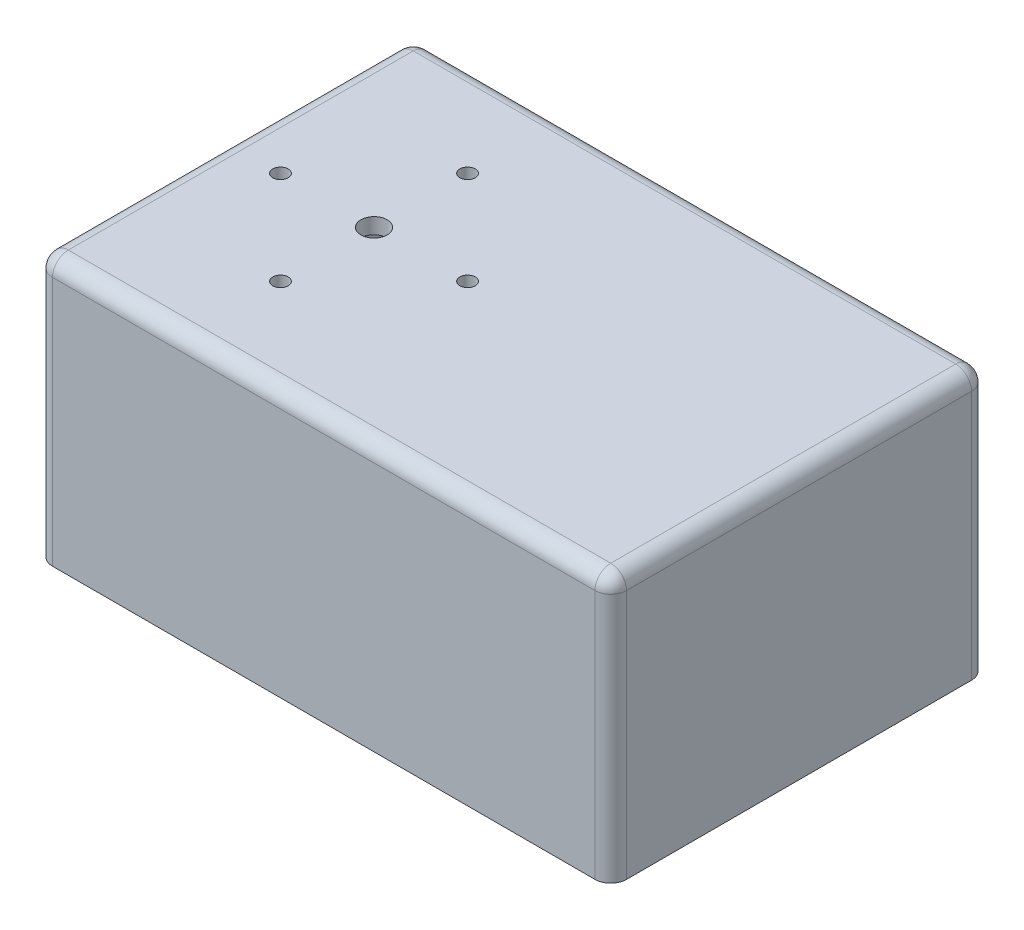
ISO-10303-21;
HEADER;
FILE_DESCRIPTION(('STEP AP214'),'2;1');
FILE_NAME('part.step','',(''),(''),'','','');
FILE_SCHEMA(('AUTOMOTIVE_DESIGN { 1 0 10303 214 1 1 1 1 }'));
ENDSEC;
DATA;
#1=APPLICATION_CONTEXT('core data for automotive mechanical design processes');
#2=APPLICATION_PROTOCOL_DEFINITION('international standard','automotive_design',2000,#1);
#3=PRODUCT_CONTEXT('',#1,'mechanical');
#4=PRODUCT('Part','Part','',(#3));
#5=PRODUCT_RELATED_PRODUCT_CATEGORY('part','',(#4));
#6=PRODUCT_DEFINITION_FORMATION('','',#4);
#7=PRODUCT_DEFINITION_CONTEXT('part definition',#1,'design');
#8=PRODUCT_DEFINITION('design','',#6,#7);
#9=PRODUCT_DEFINITION_SHAPE('','',#8);
#10=(LENGTH_UNIT() NAMED_UNIT(*) SI_UNIT(.MILLI.,.METRE.));
#11=(NAMED_UNIT(*) PLANE_ANGLE_UNIT() SI_UNIT($,.RADIAN.));
#12=(NAMED_UNIT(*) SI_UNIT($,.STERADIAN.) SOLID_ANGLE_UNIT());
#13=UNCERTAINTY_MEASURE_WITH_UNIT(LENGTH_MEASURE(1.E-05),#10,'distance_accuracy_value','');
#14=(GEOMETRIC_REPRESENTATION_CONTEXT(3) GLOBAL_UNCERTAINTY_ASSIGNED_CONTEXT((#13)) GLOBAL_UNIT_ASSIGNED_CONTEXT((#10,
#11,#12)) REPRESENTATION_CONTEXT('',''));
#15=CARTESIAN_POINT('',(0.,0.,0.));
#16=DIRECTION('',(0.,0.,1.));
#17=DIRECTION('',(1.,0.,0.));
#18=AXIS2_PLACEMENT_3D('',#15,#16,#17);
#19=CARTESIAN_POINT('',(109.,101.,-71.5));
#20=DIRECTION('',(-1.,0.,0.));
#21=DIRECTION('',(0.,0.,1.));
#22=AXIS2_PLACEMENT_3D('',#19,#20,#21);
#23=PLANE('',#22);
#24=DIRECTION('',(0.,0.,-1.));
#25=VECTOR('',#24,1.);
#26=CARTESIAN_POINT('',(109.,0.,-71.5));
#27=LINE('',#26,#25);
#28=CARTESIAN_POINT('',(109.,0.,65.5));
#29=VERTEX_POINT('',#28);
#30=CARTESIAN_POINT('',(109.,0.,-65.5));
#31=VERTEX_POINT('',#30);
#32=EDGE_CURVE('E176',#29,#31,#27,.T.);
#33=ORIENTED_EDGE('',*,*,#32,.T.);
#34=DIRECTION('',(0.,-1.,0.));
#35=VECTOR('',#34,1.);
#36=CARTESIAN_POINT('',(109.,101.,-65.5));
#37=LINE('',#36,#35);
#38=CARTESIAN_POINT('',(109.,95.,-65.5));
#39=VERTEX_POINT('',#38);
#40=EDGE_CURVE('E214',#31,#39,#37,.F.);
#41=ORIENTED_EDGE('',*,*,#40,.T.);
#42=DIRECTION('',(0.,0.,-1.));
#43=VECTOR('',#42,1.);
#44=CARTESIAN_POINT('',(109.,95.,71.5));
#45=LINE('',#44,#43);
#46=CARTESIAN_POINT('',(109.,95.,65.5));
#47=VERTEX_POINT('',#46);
#48=EDGE_CURVE('E210',#39,#47,#45,.F.);
#49=ORIENTED_EDGE('',*,*,#48,.T.);
#50=DIRECTION('',(0.,-1.,0.));
#51=VECTOR('',#50,1.);
#52=CARTESIAN_POINT('',(109.,101.,65.5));
#53=LINE('',#52,#51);
#54=EDGE_CURVE('E212',#47,#29,#53,.T.);
#55=ORIENTED_EDGE('',*,*,#54,.T.);
#56=EDGE_LOOP('',(#33,#41,#49,#55));
#57=FACE_BOUND('',#56,.T.);
#58=ADVANCED_FACE('F32',(#57),#23,.F.);
#59=CARTESIAN_POINT('',(-109.,101.,-71.5));
#60=DIRECTION('',(0.,0.,1.));
#61=DIRECTION('',(1.,0.,0.));
#62=AXIS2_PLACEMENT_3D('',#59,#60,#61);
#63=PLANE('',#62);
#64=DIRECTION('',(-1.,0.,0.));
#65=VECTOR('',#64,1.);
#66=CARTESIAN_POINT('',(-109.,0.,-71.5));
#67=LINE('',#66,#65);
#68=CARTESIAN_POINT('',(103.,0.,-71.5));
#69=VERTEX_POINT('',#68);
#70=CARTESIAN_POINT('',(-103.,0.,-71.5));
#71=VERTEX_POINT('',#70);
#72=EDGE_CURVE('E179',#69,#71,#67,.T.);
#73=ORIENTED_EDGE('',*,*,#72,.T.);
#74=DIRECTION('',(0.,-1.,0.));
#75=VECTOR('',#74,1.);
#76=CARTESIAN_POINT('',(-103.,101.,-71.5));
#77=LINE('',#76,#75);
#78=CARTESIAN_POINT('',(-103.,95.,-71.5));
#79=VERTEX_POINT('',#78);
#80=EDGE_CURVE('E208',#71,#79,#77,.F.);
#81=ORIENTED_EDGE('',*,*,#80,.T.);
#82=DIRECTION('',(-1.,0.,0.));
#83=VECTOR('',#82,1.);
#84=CARTESIAN_POINT('',(109.,95.,-71.5));
#85=LINE('',#84,#83);
#86=CARTESIAN_POINT('',(103.,95.,-71.5));
#87=VERTEX_POINT('',#86);
#88=EDGE_CURVE('E204',#79,#87,#85,.F.);
#89=ORIENTED_EDGE('',*,*,#88,.T.);
#90=DIRECTION('',(0.,-1.,0.));
#91=VECTOR('',#90,1.);
#92=CARTESIAN_POINT('',(103.,101.,-71.5));
#93=LINE('',#92,#91);
#94=EDGE_CURVE('E206',#87,#69,#93,.T.);
#95=ORIENTED_EDGE('',*,*,#94,.T.);
#96=EDGE_LOOP('',(#73,#81,#89,#95));
#97=FACE_BOUND('',#96,.T.);
#98=ADVANCED_FACE('F290',(#97),#63,.F.);
#99=CARTESIAN_POINT('',(-109.,101.,-71.5));
#100=DIRECTION('',(1.,0.,0.));
#101=DIRECTION('',(0.,0.,-1.));
#102=AXIS2_PLACEMENT_3D('',#99,#100,#101);
#103=PLANE('',#102);
#104=DIRECTION('',(0.,0.,1.));
#105=VECTOR('',#104,1.);
#106=CARTESIAN_POINT('',(-109.,95.,-71.5));
#107=LINE('',#106,#105);
#108=CARTESIAN_POINT('',(-109.,95.,65.5));
#109=VERTEX_POINT('',#108);
#110=CARTESIAN_POINT('',(-109.,95.,-65.5));
#111=VERTEX_POINT('',#110);
#112=EDGE_CURVE('E189',#109,#111,#107,.F.);
#113=ORIENTED_EDGE('',*,*,#112,.T.);
#114=DIRECTION('',(0.,-1.,0.));
#115=VECTOR('',#114,1.);
#116=CARTESIAN_POINT('',(-109.,101.,-65.5));
#117=LINE('',#116,#115);
#118=CARTESIAN_POINT('',(-109.,0.,-65.5));
#119=VERTEX_POINT('',#118);
#120=EDGE_CURVE('E193',#111,#119,#117,.T.);
#121=ORIENTED_EDGE('',*,*,#120,.T.);
#122=DIRECTION('',(0.,0.,1.));
#123=VECTOR('',#122,1.);
#124=CARTESIAN_POINT('',(-109.,0.,-71.5));
#125=LINE('',#124,#123);
#126=CARTESIAN_POINT('',(-109.,0.,65.5));
#127=VERTEX_POINT('',#126);
#128=EDGE_CURVE('E183',#119,#127,#125,.T.);
#129=ORIENTED_EDGE('',*,*,#128,.T.);
#130=DIRECTION('',(0.,-1.,0.));
#131=VECTOR('',#130,1.);
#132=CARTESIAN_POINT('',(-109.,101.,65.5));
#133=LINE('',#132,#131);
#134=EDGE_CURVE('E191',#127,#109,#133,.F.);
#135=ORIENTED_EDGE('',*,*,#134,.T.);
#136=EDGE_LOOP('',(#113,#121,#129,#135));
#137=FACE_BOUND('',#136,.T.);
#138=ADVANCED_FACE('F296',(#137),#103,.F.);
#139=CARTESIAN_POINT('',(-109.,101.,71.5));
#140=DIRECTION('',(0.,0.,-1.));
#141=DIRECTION('',(-1.,0.,0.));
#142=AXIS2_PLACEMENT_3D('',#139,#140,#141);
#143=PLANE('',#142);
#144=DIRECTION('',(1.,0.,0.));
#145=VECTOR('',#144,1.);
#146=CARTESIAN_POINT('',(-109.,0.,71.5));
#147=LINE('',#146,#145);
#148=CARTESIAN_POINT('',(-103.,0.,71.5));
#149=VERTEX_POINT('',#148);
#150=CARTESIAN_POINT('',(103.,0.,71.5));
#151=VERTEX_POINT('',#150);
#152=EDGE_CURVE('E186',#149,#151,#147,.T.);
#153=ORIENTED_EDGE('',*,*,#152,.T.);
#154=DIRECTION('',(0.,-1.,0.));
#155=VECTOR('',#154,1.);
#156=CARTESIAN_POINT('',(103.,101.,71.5));
#157=LINE('',#156,#155);
#158=CARTESIAN_POINT('',(103.,95.,71.5));
#159=VERTEX_POINT('',#158);
#160=EDGE_CURVE('E220',#151,#159,#157,.F.);
#161=ORIENTED_EDGE('',*,*,#160,.T.);
#162=DIRECTION('',(1.,0.,0.));
#163=VECTOR('',#162,1.);
#164=CARTESIAN_POINT('',(-109.,95.,71.5));
#165=LINE('',#164,#163);
#166=CARTESIAN_POINT('',(-103.,95.,71.5));
#167=VERTEX_POINT('',#166);
#168=EDGE_CURVE('E216',#159,#167,#165,.F.);
#169=ORIENTED_EDGE('',*,*,#168,.T.);
#170=DIRECTION('',(0.,-1.,0.));
#171=VECTOR('',#170,1.);
#172=CARTESIAN_POINT('',(-103.,101.,71.5));
#173=LINE('',#172,#171);
#174=EDGE_CURVE('E218',#167,#149,#173,.T.);
#175=ORIENTED_EDGE('',*,*,#174,.T.);
#176=EDGE_LOOP('',(#153,#161,#169,#175));
#177=FACE_BOUND('',#176,.T.);
#178=ADVANCED_FACE('F357',(#177),#143,.F.);
#179=CARTESIAN_POINT('',(0.,101.,0.));
#180=DIRECTION('',(0.,1.,0.));
#181=DIRECTION('',(0.,0.,1.));
#182=AXIS2_PLACEMENT_3D('',#179,#180,#181);
#183=PLANE('',#182);
#184=CARTESIAN_POINT('',(-52.4,101.,-35.525));
#185=DIRECTION('',(0.,1.,0.));
#186=DIRECTION('',(0.,0.,1.));
#187=AXIS2_PLACEMENT_3D('',#184,#185,#186);
#188=CIRCLE('',#187,2.925);
#189=CARTESIAN_POINT('',(-52.4,101.,-32.6));
#190=VERTEX_POINT('',#189);
#191=EDGE_CURVE('E590',#190,#190,#188,.T.);
#192=ORIENTED_EDGE('',*,*,#191,.F.);
#193=EDGE_LOOP('',(#192));
#194=FACE_BOUND('',#193,.T.);
#195=CARTESIAN_POINT('',(-87.925,101.,0.));
#196=DIRECTION('',(0.,1.,0.));
#197=DIRECTION('',(0.,0.,1.));
#198=AXIS2_PLACEMENT_3D('',#195,#196,#197);
#199=CIRCLE('',#198,2.925);
#200=CARTESIAN_POINT('',(-87.925,101.,2.925));
#201=VERTEX_POINT('',#200);
#202=EDGE_CURVE('E586',#201,#201,#199,.T.);
#203=ORIENTED_EDGE('',*,*,#202,.F.);
#204=EDGE_LOOP('',(#203));
#205=FACE_BOUND('',#204,.T.);
#206=CARTESIAN_POINT('',(-52.4,101.,35.525));
#207=DIRECTION('',(0.,1.,0.));
#208=DIRECTION('',(0.,0.,1.));
#209=AXIS2_PLACEMENT_3D('',#206,#207,#208);
#210=CIRCLE('',#209,2.925);
#211=CARTESIAN_POINT('',(-52.4,101.,38.45));
#212=VERTEX_POINT('',#211);
#213=EDGE_CURVE('E576',#212,#212,#210,.T.);
#214=ORIENTED_EDGE('',*,*,#213,.F.);
#215=EDGE_LOOP('',(#214));
#216=FACE_BOUND('',#215,.T.);
#217=CARTESIAN_POINT('',(-16.875,101.,0.));
#218=DIRECTION('',(0.,1.,0.));
#219=DIRECTION('',(0.,0.,1.));
#220=AXIS2_PLACEMENT_3D('',#217,#218,#219);
#221=CIRCLE('',#220,2.925);
#222=CARTESIAN_POINT('',(-16.875,101.,2.925));
#223=VERTEX_POINT('',#222);
#224=EDGE_CURVE('E587',#223,#223,#221,.T.);
#225=ORIENTED_EDGE('',*,*,#224,.F.);
#226=EDGE_LOOP('',(#225));
#227=FACE_BOUND('',#226,.T.);
#228=CARTESIAN_POINT('',(-52.4,101.,0.));
#229=DIRECTION('',(0.,1.,0.));
#230=DIRECTION('',(0.,0.,1.));
#231=AXIS2_PLACEMENT_3D('',#228,#229,#230);
#232=CIRCLE('',#231,5.);
#233=CARTESIAN_POINT('',(-52.4,101.,5.));
#234=VERTEX_POINT('',#233);
#235=EDGE_CURVE('E160',#234,#234,#232,.T.);
#236=ORIENTED_EDGE('',*,*,#235,.F.);
#237=EDGE_LOOP('',(#236));
#238=FACE_BOUND('',#237,.T.);
#239=DIRECTION('',(-1.,0.,0.));
#240=VECTOR('',#239,1.);
#241=CARTESIAN_POINT('',(-109.,101.,-65.5));
#242=LINE('',#241,#240);
#243=CARTESIAN_POINT('',(103.,101.,-65.5));
#244=VERTEX_POINT('',#243);
#245=CARTESIAN_POINT('',(-103.,101.,-65.5));
#246=VERTEX_POINT('',#245);
#247=EDGE_CURVE('E41',#244,#246,#242,.T.);
#248=ORIENTED_EDGE('',*,*,#247,.T.);
#249=DIRECTION('',(0.,0.,1.));
#250=VECTOR('',#249,1.);
#251=CARTESIAN_POINT('',(-103.,101.,71.5));
#252=LINE('',#251,#250);
#253=CARTESIAN_POINT('',(-103.,101.,65.5));
#254=VERTEX_POINT('',#253);
#255=EDGE_CURVE('E11',#246,#254,#252,.T.);
#256=ORIENTED_EDGE('',*,*,#255,.T.);
#257=DIRECTION('',(1.,0.,0.));
#258=VECTOR('',#257,1.);
#259=CARTESIAN_POINT('',(109.,101.,65.5));
#260=LINE('',#259,#258);
#261=CARTESIAN_POINT('',(103.,101.,65.5));
#262=VERTEX_POINT('',#261);
#263=EDGE_CURVE('E222',#254,#262,#260,.T.);
#264=ORIENTED_EDGE('',*,*,#263,.T.);
#265=DIRECTION('',(0.,0.,-1.));
#266=VECTOR('',#265,1.);
#267=CARTESIAN_POINT('',(103.,101.,-71.5));
#268=LINE('',#267,#266);
#269=EDGE_CURVE('E224',#262,#244,#268,.T.);
#270=ORIENTED_EDGE('',*,*,#269,.T.);
#271=EDGE_LOOP('',(#248,#256,#264,#270));
#272=FACE_BOUND('',#271,.T.);
#273=ADVANCED_FACE('F381',(#194,#205,#216,#227,#238,#272),#183,.T.);
#274=CARTESIAN_POINT('',(0.,0.,0.));
#275=DIRECTION('',(0.,1.,0.));
#276=DIRECTION('',(0.,0.,1.));
#277=AXIS2_PLACEMENT_3D('',#274,#275,#276);
#278=PLANE('',#277);
#279=DIRECTION('',(-1.,0.,0.));
#280=VECTOR('',#279,1.);
#281=CARTESIAN_POINT('',(-109.,0.,-65.5));
#282=LINE('',#281,#280);
#283=CARTESIAN_POINT('',(103.,0.,-65.5));
#284=VERTEX_POINT('',#283);
#285=CARTESIAN_POINT('',(-103.,0.,-65.5));
#286=VERTEX_POINT('',#285);
#287=EDGE_CURVE('E156',#284,#286,#282,.T.);
#288=ORIENTED_EDGE('',*,*,#287,.T.);
#289=DIRECTION('',(0.,0.,1.));
#290=VECTOR('',#289,1.);
#291=CARTESIAN_POINT('',(-103.,0.,-71.5));
#292=LINE('',#291,#290);
#293=CARTESIAN_POINT('',(-103.,0.,65.5));
#294=VERTEX_POINT('',#293);
#295=EDGE_CURVE('E172',#286,#294,#292,.T.);
#296=ORIENTED_EDGE('',*,*,#295,.T.);
#297=DIRECTION('',(1.,0.,0.));
#298=VECTOR('',#297,1.);
#299=CARTESIAN_POINT('',(-109.,0.,65.5));
#300=LINE('',#299,#298);
#301=CARTESIAN_POINT('',(103.,0.,65.5));
#302=VERTEX_POINT('',#301);
#303=EDGE_CURVE('E152',#294,#302,#300,.T.);
#304=ORIENTED_EDGE('',*,*,#303,.T.);
#305=DIRECTION('',(0.,0.,-1.));
#306=VECTOR('',#305,1.);
#307=CARTESIAN_POINT('',(103.,0.,-71.5));
#308=LINE('',#307,#306);
#309=EDGE_CURVE('E49',#302,#284,#308,.T.);
#310=ORIENTED_EDGE('',*,*,#309,.T.);
#311=EDGE_LOOP('',(#288,#296,#304,#310));
#312=FACE_BOUND('',#311,.T.);
#313=ORIENTED_EDGE('',*,*,#128,.F.);
#314=CARTESIAN_POINT('',(-103.,0.,-65.5));
#315=DIRECTION('',(0.,1.,0.));
#316=DIRECTION('',(0.,0.,1.));
#317=AXIS2_PLACEMENT_3D('',#314,#315,#316);
#318=CIRCLE('',#317,6.);
#319=EDGE_CURVE('E202',#119,#71,#318,.F.);
#320=ORIENTED_EDGE('',*,*,#319,.T.);
#321=ORIENTED_EDGE('',*,*,#72,.F.);
#322=CARTESIAN_POINT('',(103.,0.,-65.5));
#323=DIRECTION('',(0.,1.,0.));
#324=DIRECTION('',(0.,0.,1.));
#325=AXIS2_PLACEMENT_3D('',#322,#323,#324);
#326=CIRCLE('',#325,6.);
#327=EDGE_CURVE('E200',#69,#31,#326,.F.);
#328=ORIENTED_EDGE('',*,*,#327,.T.);
#329=ORIENTED_EDGE('',*,*,#32,.F.);
#330=CARTESIAN_POINT('',(103.,0.,65.5));
#331=DIRECTION('',(0.,1.,0.));
#332=DIRECTION('',(0.,0.,1.));
#333=AXIS2_PLACEMENT_3D('',#330,#331,#332);
#334=CIRCLE('',#333,6.);
#335=EDGE_CURVE('E198',#29,#151,#334,.F.);
#336=ORIENTED_EDGE('',*,*,#335,.T.);
#337=ORIENTED_EDGE('',*,*,#152,.F.);
#338=CARTESIAN_POINT('',(-103.,0.,65.5));
#339=DIRECTION('',(0.,1.,0.));
#340=DIRECTION('',(0.,0.,1.));
#341=AXIS2_PLACEMENT_3D('',#338,#339,#340);
#342=CIRCLE('',#341,6.);
#343=EDGE_CURVE('E196',#149,#127,#342,.F.);
#344=ORIENTED_EDGE('',*,*,#343,.T.);
#345=EDGE_LOOP('',(#313,#320,#321,#328,#329,#336,#337,#344));
#346=FACE_BOUND('',#345,.T.);
#347=ADVANCED_FACE('F346',(#312,#346),#278,.F.);
#348=CARTESIAN_POINT('',(103.,101.,65.5));
#349=DIRECTION('',(0.,-1.,0.));
#350=DIRECTION('',(0.,0.,-1.));
#351=AXIS2_PLACEMENT_3D('',#348,#349,#350);
#352=CYLINDRICAL_SURFACE('',#351,6.);
#353=CARTESIAN_POINT('',(103.,95.,65.5));
#354=DIRECTION('',(0.,1.,0.));
#355=DIRECTION('',(0.,0.,1.));
#356=AXIS2_PLACEMENT_3D('',#353,#354,#355);
#357=CIRCLE('',#356,6.);
#358=EDGE_CURVE('E180',#159,#47,#357,.T.);
#359=ORIENTED_EDGE('',*,*,#358,.F.);
#360=ORIENTED_EDGE('',*,*,#160,.F.);
#361=ORIENTED_EDGE('',*,*,#335,.F.);
#362=ORIENTED_EDGE('',*,*,#54,.F.);
#363=EDGE_LOOP('',(#359,#360,#361,#362));
#364=FACE_BOUND('',#363,.T.);
#365=ADVANCED_FACE('F34',(#364),#352,.T.);
#366=CARTESIAN_POINT('',(103.,95.,65.5));
#367=DIRECTION('',(1.,0.,0.));
#368=DIRECTION('',(0.,0.,-1.));
#369=AXIS2_PLACEMENT_3D('',#366,#367,#368);
#370=SPHERICAL_SURFACE('',#369,6.);
#371=CARTESIAN_POINT('',(103.,95.,65.5));
#372=DIRECTION('',(1.,0.,0.));
#373=DIRECTION('',(0.,0.,-1.));
#374=AXIS2_PLACEMENT_3D('',#371,#372,#373);
#375=CIRCLE('',#374,6.);
#376=EDGE_CURVE('E252',#159,#262,#375,.F.);
#377=ORIENTED_EDGE('',*,*,#376,.F.);
#378=ORIENTED_EDGE('',*,*,#358,.T.);
#379=CARTESIAN_POINT('',(103.,95.,65.5));
#380=DIRECTION('',(0.,0.,1.));
#381=DIRECTION('',(1.,0.,0.));
#382=AXIS2_PLACEMENT_3D('',#379,#380,#381);
#383=CIRCLE('',#382,6.);
#384=EDGE_CURVE('E255',#262,#47,#383,.F.);
#385=ORIENTED_EDGE('',*,*,#384,.F.);
#386=EDGE_LOOP('',(#377,#378,#385));
#387=FACE_BOUND('',#386,.T.);
#388=ADVANCED_FACE('F339',(#387),#370,.T.);
#389=CARTESIAN_POINT('',(103.,101.,-65.5));
#390=DIRECTION('',(0.,-1.,0.));
#391=DIRECTION('',(0.,0.,-1.));
#392=AXIS2_PLACEMENT_3D('',#389,#390,#391);
#393=CYLINDRICAL_SURFACE('',#392,6.);
#394=ORIENTED_EDGE('',*,*,#327,.F.);
#395=ORIENTED_EDGE('',*,*,#94,.F.);
#396=CARTESIAN_POINT('',(103.,95.,-65.5));
#397=DIRECTION('',(0.,1.,0.));
#398=DIRECTION('',(0.,0.,1.));
#399=AXIS2_PLACEMENT_3D('',#396,#397,#398);
#400=CIRCLE('',#399,6.);
#401=EDGE_CURVE('E249',#39,#87,#400,.T.);
#402=ORIENTED_EDGE('',*,*,#401,.F.);
#403=ORIENTED_EDGE('',*,*,#40,.F.);
#404=EDGE_LOOP('',(#394,#395,#402,#403));
#405=FACE_BOUND('',#404,.T.);
#406=ADVANCED_FACE('F336',(#405),#393,.T.);
#407=CARTESIAN_POINT('',(103.,95.,0.));
#408=DIRECTION('',(0.,0.,1.));
#409=DIRECTION('',(1.,0.,0.));
#410=AXIS2_PLACEMENT_3D('',#407,#408,#409);
#411=CYLINDRICAL_SURFACE('',#410,6.);
#412=ORIENTED_EDGE('',*,*,#384,.T.);
#413=ORIENTED_EDGE('',*,*,#48,.F.);
#414=CARTESIAN_POINT('',(103.,95.,-65.5));
#415=DIRECTION('',(0.,0.,-1.));
#416=DIRECTION('',(-1.,0.,0.));
#417=AXIS2_PLACEMENT_3D('',#414,#415,#416);
#418=CIRCLE('',#417,6.);
#419=EDGE_CURVE('E246',#244,#39,#418,.T.);
#420=ORIENTED_EDGE('',*,*,#419,.F.);
#421=ORIENTED_EDGE('',*,*,#269,.F.);
#422=EDGE_LOOP('',(#412,#413,#420,#421));
#423=FACE_BOUND('',#422,.T.);
#424=ADVANCED_FACE('F332',(#423),#411,.T.);
#425=CARTESIAN_POINT('',(0.,95.,65.5));
#426=DIRECTION('',(-1.,0.,0.));
#427=DIRECTION('',(0.,0.,1.));
#428=AXIS2_PLACEMENT_3D('',#425,#426,#427);
#429=CYLINDRICAL_SURFACE('',#428,6.);
#430=ORIENTED_EDGE('',*,*,#376,.T.);
#431=ORIENTED_EDGE('',*,*,#263,.F.);
#432=CARTESIAN_POINT('',(-103.,95.,65.5));
#433=DIRECTION('',(-1.,0.,0.));
#434=DIRECTION('',(0.,0.,1.));
#435=AXIS2_PLACEMENT_3D('',#432,#433,#434);
#436=CIRCLE('',#435,6.);
#437=EDGE_CURVE('E243',#167,#254,#436,.T.);
#438=ORIENTED_EDGE('',*,*,#437,.F.);
#439=ORIENTED_EDGE('',*,*,#168,.F.);
#440=EDGE_LOOP('',(#430,#431,#438,#439));
#441=FACE_BOUND('',#440,.T.);
#442=ADVANCED_FACE('F328',(#441),#429,.T.);
#443=CARTESIAN_POINT('',(-103.,101.,65.5));
#444=DIRECTION('',(0.,-1.,0.));
#445=DIRECTION('',(0.,0.,-1.));
#446=AXIS2_PLACEMENT_3D('',#443,#444,#445);
#447=CYLINDRICAL_SURFACE('',#446,6.);
#448=ORIENTED_EDGE('',*,*,#343,.F.);
#449=ORIENTED_EDGE('',*,*,#174,.F.);
#450=CARTESIAN_POINT('',(-103.,95.,65.5));
#451=DIRECTION('',(0.,1.,0.));
#452=DIRECTION('',(0.,0.,1.));
#453=AXIS2_PLACEMENT_3D('',#450,#451,#452);
#454=CIRCLE('',#453,6.);
#455=EDGE_CURVE('E240',#109,#167,#454,.T.);
#456=ORIENTED_EDGE('',*,*,#455,.F.);
#457=ORIENTED_EDGE('',*,*,#134,.F.);
#458=EDGE_LOOP('',(#448,#449,#456,#457));
#459=FACE_BOUND('',#458,.T.);
#460=ADVANCED_FACE('F324',(#459),#447,.T.);
#461=CARTESIAN_POINT('',(103.,95.,-65.5));
#462=DIRECTION('',(1.,0.,0.));
#463=DIRECTION('',(0.,0.,-1.));
#464=AXIS2_PLACEMENT_3D('',#461,#462,#463);
#465=SPHERICAL_SURFACE('',#464,6.);
#466=ORIENTED_EDGE('',*,*,#419,.T.);
#467=ORIENTED_EDGE('',*,*,#401,.T.);
#468=CARTESIAN_POINT('',(103.,95.,-65.5));
#469=DIRECTION('',(1.,0.,0.));
#470=DIRECTION('',(0.,0.,-1.));
#471=AXIS2_PLACEMENT_3D('',#468,#469,#470);
#472=CIRCLE('',#471,6.);
#473=EDGE_CURVE('E237',#244,#87,#472,.F.);
#474=ORIENTED_EDGE('',*,*,#473,.F.);
#475=EDGE_LOOP('',(#466,#467,#474));
#476=FACE_BOUND('',#475,.T.);
#477=ADVANCED_FACE('F320',(#476),#465,.T.);
#478=CARTESIAN_POINT('',(-103.,95.,65.5));
#479=DIRECTION('',(0.,0.,1.));
#480=DIRECTION('',(1.,0.,0.));
#481=AXIS2_PLACEMENT_3D('',#478,#479,#480);
#482=SPHERICAL_SURFACE('',#481,6.);
#483=ORIENTED_EDGE('',*,*,#455,.T.);
#484=ORIENTED_EDGE('',*,*,#437,.T.);
#485=CARTESIAN_POINT('',(-103.,95.,65.5));
#486=DIRECTION('',(0.,0.,1.));
#487=DIRECTION('',(1.,0.,0.));
#488=AXIS2_PLACEMENT_3D('',#485,#486,#487);
#489=CIRCLE('',#488,6.);
#490=EDGE_CURVE('E235',#109,#254,#489,.F.);
#491=ORIENTED_EDGE('',*,*,#490,.F.);
#492=EDGE_LOOP('',(#483,#484,#491));
#493=FACE_BOUND('',#492,.T.);
#494=ADVANCED_FACE('F316',(#493),#482,.T.);
#495=CARTESIAN_POINT('',(0.,95.,-65.5));
#496=DIRECTION('',(1.,0.,0.));
#497=DIRECTION('',(0.,0.,-1.));
#498=AXIS2_PLACEMENT_3D('',#495,#496,#497);
#499=CYLINDRICAL_SURFACE('',#498,6.);
#500=ORIENTED_EDGE('',*,*,#473,.T.);
#501=ORIENTED_EDGE('',*,*,#88,.F.);
#502=CARTESIAN_POINT('',(-103.,95.,-65.5));
#503=DIRECTION('',(-1.,0.,0.));
#504=DIRECTION('',(0.,0.,1.));
#505=AXIS2_PLACEMENT_3D('',#502,#503,#504);
#506=CIRCLE('',#505,6.);
#507=EDGE_CURVE('E232',#246,#79,#506,.T.);
#508=ORIENTED_EDGE('',*,*,#507,.F.);
#509=ORIENTED_EDGE('',*,*,#247,.F.);
#510=EDGE_LOOP('',(#500,#501,#508,#509));
#511=FACE_BOUND('',#510,.T.);
#512=ADVANCED_FACE('F312',(#511),#499,.T.);
#513=CARTESIAN_POINT('',(-103.,95.,0.));
#514=DIRECTION('',(0.,0.,-1.));
#515=DIRECTION('',(-1.,0.,0.));
#516=AXIS2_PLACEMENT_3D('',#513,#514,#515);
#517=CYLINDRICAL_SURFACE('',#516,6.);
#518=ORIENTED_EDGE('',*,*,#490,.T.);
#519=ORIENTED_EDGE('',*,*,#255,.F.);
#520=CARTESIAN_POINT('',(-103.,95.,-65.5));
#521=DIRECTION('',(0.,0.,-1.));
#522=DIRECTION('',(-1.,0.,0.));
#523=AXIS2_PLACEMENT_3D('',#520,#521,#522);
#524=CIRCLE('',#523,6.);
#525=EDGE_CURVE('E229',#111,#246,#524,.T.);
#526=ORIENTED_EDGE('',*,*,#525,.F.);
#527=ORIENTED_EDGE('',*,*,#112,.F.);
#528=EDGE_LOOP('',(#518,#519,#526,#527));
#529=FACE_BOUND('',#528,.T.);
#530=ADVANCED_FACE('F308',(#529),#517,.T.);
#531=CARTESIAN_POINT('',(-103.,95.,-65.5));
#532=DIRECTION('',(0.,1.,0.));
#533=DIRECTION('',(0.,0.,1.));
#534=AXIS2_PLACEMENT_3D('',#531,#532,#533);
#535=SPHERICAL_SURFACE('',#534,6.);
#536=ORIENTED_EDGE('',*,*,#525,.T.);
#537=ORIENTED_EDGE('',*,*,#507,.T.);
#538=CARTESIAN_POINT('',(-103.,95.,-65.5));
#539=DIRECTION('',(0.,1.,0.));
#540=DIRECTION('',(0.,0.,1.));
#541=AXIS2_PLACEMENT_3D('',#538,#539,#540);
#542=CIRCLE('',#541,6.);
#543=EDGE_CURVE('E166',#111,#79,#542,.F.);
#544=ORIENTED_EDGE('',*,*,#543,.F.);
#545=EDGE_LOOP('',(#536,#537,#544));
#546=FACE_BOUND('',#545,.T.);
#547=ADVANCED_FACE('F304',(#546),#535,.T.);
#548=CARTESIAN_POINT('',(-103.,101.,-65.5));
#549=DIRECTION('',(0.,-1.,0.));
#550=DIRECTION('',(0.,0.,-1.));
#551=AXIS2_PLACEMENT_3D('',#548,#549,#550);
#552=CYLINDRICAL_SURFACE('',#551,6.);
#553=ORIENTED_EDGE('',*,*,#543,.T.);
#554=ORIENTED_EDGE('',*,*,#80,.F.);
#555=ORIENTED_EDGE('',*,*,#319,.F.);
#556=ORIENTED_EDGE('',*,*,#120,.F.);
#557=EDGE_LOOP('',(#553,#554,#555,#556));
#558=FACE_BOUND('',#557,.T.);
#559=ADVANCED_FACE('F301',(#558),#552,.T.);
#560=CARTESIAN_POINT('',(103.,101.,-71.5));
#561=DIRECTION('',(-1.,0.,0.));
#562=DIRECTION('',(0.,0.,1.));
#563=AXIS2_PLACEMENT_3D('',#560,#561,#562);
#564=PLANE('',#563);
#565=ORIENTED_EDGE('',*,*,#309,.F.);
#566=DIRECTION('',(0.,1.,0.));
#567=VECTOR('',#566,1.);
#568=CARTESIAN_POINT('',(103.,101.,65.5));
#569=LINE('',#568,#567);
#570=CARTESIAN_POINT('',(103.,95.,65.5));
#571=VERTEX_POINT('',#570);
#572=EDGE_CURVE('E139',#302,#571,#569,.T.);
#573=ORIENTED_EDGE('',*,*,#572,.T.);
#574=DIRECTION('',(0.,0.,1.));
#575=VECTOR('',#574,1.);
#576=CARTESIAN_POINT('',(103.,95.,0.));
#577=LINE('',#576,#575);
#578=CARTESIAN_POINT('',(103.,95.,-65.5));
#579=VERTEX_POINT('',#578);
#580=EDGE_CURVE('E133',#579,#571,#577,.T.);
#581=ORIENTED_EDGE('',*,*,#580,.F.);
#582=DIRECTION('',(0.,-1.,0.));
#583=VECTOR('',#582,1.);
#584=CARTESIAN_POINT('',(103.,101.,-65.5));
#585=LINE('',#584,#583);
#586=EDGE_CURVE('E137',#579,#284,#585,.T.);
#587=ORIENTED_EDGE('',*,*,#586,.T.);
#588=EDGE_LOOP('',(#565,#573,#581,#587));
#589=FACE_BOUND('',#588,.T.);
#590=ADVANCED_FACE('F135',(#589),#564,.T.);
#591=CARTESIAN_POINT('',(-109.,101.,-65.5));
#592=DIRECTION('',(0.,0.,1.));
#593=DIRECTION('',(1.,0.,0.));
#594=AXIS2_PLACEMENT_3D('',#591,#592,#593);
#595=PLANE('',#594);
#596=ORIENTED_EDGE('',*,*,#287,.F.);
#597=ORIENTED_EDGE('',*,*,#586,.F.);
#598=DIRECTION('',(1.,0.,0.));
#599=VECTOR('',#598,1.);
#600=CARTESIAN_POINT('',(0.,95.,-65.5));
#601=LINE('',#600,#599);
#602=CARTESIAN_POINT('',(-103.,95.,-65.5));
#603=VERTEX_POINT('',#602);
#604=EDGE_CURVE('E146',#603,#579,#601,.T.);
#605=ORIENTED_EDGE('',*,*,#604,.F.);
#606=DIRECTION('',(0.,1.,0.));
#607=VECTOR('',#606,1.);
#608=CARTESIAN_POINT('',(-103.,101.,-65.5));
#609=LINE('',#608,#607);
#610=EDGE_CURVE('E143',#286,#603,#609,.T.);
#611=ORIENTED_EDGE('',*,*,#610,.F.);
#612=EDGE_LOOP('',(#596,#597,#605,#611));
#613=FACE_BOUND('',#612,.T.);
#614=ADVANCED_FACE('F154',(#613),#595,.T.);
#615=CARTESIAN_POINT('',(-103.,101.,-71.5));
#616=DIRECTION('',(1.,0.,0.));
#617=DIRECTION('',(0.,0.,-1.));
#618=AXIS2_PLACEMENT_3D('',#615,#616,#617);
#619=PLANE('',#618);
#620=DIRECTION('',(0.,0.,1.));
#621=VECTOR('',#620,1.);
#622=CARTESIAN_POINT('',(-103.,95.,-71.5));
#623=LINE('',#622,#621);
#624=CARTESIAN_POINT('',(-103.,95.,65.5));
#625=VERTEX_POINT('',#624);
#626=EDGE_CURVE('E149',#603,#625,#623,.T.);
#627=ORIENTED_EDGE('',*,*,#626,.T.);
#628=DIRECTION('',(0.,-1.,0.));
#629=VECTOR('',#628,1.);
#630=CARTESIAN_POINT('',(-103.,101.,65.5));
#631=LINE('',#630,#629);
#632=EDGE_CURVE('E142',#625,#294,#631,.T.);
#633=ORIENTED_EDGE('',*,*,#632,.T.);
#634=ORIENTED_EDGE('',*,*,#295,.F.);
#635=ORIENTED_EDGE('',*,*,#610,.T.);
#636=EDGE_LOOP('',(#627,#633,#634,#635));
#637=FACE_BOUND('',#636,.T.);
#638=ADVANCED_FACE('F503',(#637),#619,.T.);
#639=CARTESIAN_POINT('',(-109.,101.,65.5));
#640=DIRECTION('',(0.,0.,-1.));
#641=DIRECTION('',(-1.,0.,0.));
#642=AXIS2_PLACEMENT_3D('',#639,#640,#641);
#643=PLANE('',#642);
#644=ORIENTED_EDGE('',*,*,#303,.F.);
#645=ORIENTED_EDGE('',*,*,#632,.F.);
#646=DIRECTION('',(1.,0.,0.));
#647=VECTOR('',#646,1.);
#648=CARTESIAN_POINT('',(-109.,95.,65.5));
#649=LINE('',#648,#647);
#650=EDGE_CURVE('E163',#625,#571,#649,.T.);
#651=ORIENTED_EDGE('',*,*,#650,.T.);
#652=ORIENTED_EDGE('',*,*,#572,.F.);
#653=EDGE_LOOP('',(#644,#645,#651,#652));
#654=FACE_BOUND('',#653,.T.);
#655=ADVANCED_FACE('F512',(#654),#643,.T.);
#656=CARTESIAN_POINT('',(0.,95.,0.));
#657=DIRECTION('',(0.,1.,0.));
#658=DIRECTION('',(0.,0.,1.));
#659=AXIS2_PLACEMENT_3D('',#656,#657,#658);
#660=PLANE('',#659);
#661=CARTESIAN_POINT('',(-52.4,95.,-35.525));
#662=DIRECTION('',(0.,1.,0.));
#663=DIRECTION('',(0.,0.,1.));
#664=AXIS2_PLACEMENT_3D('',#661,#662,#663);
#665=CIRCLE('',#664,2.925);
#666=CARTESIAN_POINT('',(-52.4,95.,-32.6));
#667=VERTEX_POINT('',#666);
#668=EDGE_CURVE('E36',#667,#667,#665,.T.);
#669=ORIENTED_EDGE('',*,*,#668,.T.);
#670=EDGE_LOOP('',(#669));
#671=FACE_BOUND('',#670,.T.);
#672=CARTESIAN_POINT('',(-87.925,95.,0.));
#673=DIRECTION('',(0.,1.,0.));
#674=DIRECTION('',(0.,0.,1.));
#675=AXIS2_PLACEMENT_3D('',#672,#673,#674);
#676=CIRCLE('',#675,2.925);
#677=CARTESIAN_POINT('',(-87.925,95.,2.925));
#678=VERTEX_POINT('',#677);
#679=EDGE_CURVE('E268',#678,#678,#676,.T.);
#680=ORIENTED_EDGE('',*,*,#679,.T.);
#681=EDGE_LOOP('',(#680));
#682=FACE_BOUND('',#681,.T.);
#683=CARTESIAN_POINT('',(-52.4,95.,35.525));
#684=DIRECTION('',(0.,1.,0.));
#685=DIRECTION('',(0.,0.,1.));
#686=AXIS2_PLACEMENT_3D('',#683,#684,#685);
#687=CIRCLE('',#686,2.925);
#688=CARTESIAN_POINT('',(-52.4,95.,38.45));
#689=VERTEX_POINT('',#688);
#690=EDGE_CURVE('E266',#689,#689,#687,.T.);
#691=ORIENTED_EDGE('',*,*,#690,.T.);
#692=EDGE_LOOP('',(#691));
#693=FACE_BOUND('',#692,.T.);
#694=CARTESIAN_POINT('',(-16.875,95.,0.));
#695=DIRECTION('',(0.,1.,0.));
#696=DIRECTION('',(0.,0.,1.));
#697=AXIS2_PLACEMENT_3D('',#694,#695,#696);
#698=CIRCLE('',#697,2.925);
#699=CARTESIAN_POINT('',(-16.875,95.,2.925));
#700=VERTEX_POINT('',#699);
#701=EDGE_CURVE('E263',#700,#700,#698,.T.);
#702=ORIENTED_EDGE('',*,*,#701,.T.);
#703=EDGE_LOOP('',(#702));
#704=FACE_BOUND('',#703,.T.);
#705=CARTESIAN_POINT('',(-52.4,95.,0.));
#706=DIRECTION('',(0.,1.,0.));
#707=DIRECTION('',(0.,0.,1.));
#708=AXIS2_PLACEMENT_3D('',#705,#706,#707);
#709=CIRCLE('',#708,5.);
#710=CARTESIAN_POINT('',(-52.4,95.,5.));
#711=VERTEX_POINT('',#710);
#712=EDGE_CURVE('E260',#711,#711,#709,.T.);
#713=ORIENTED_EDGE('',*,*,#712,.T.);
#714=EDGE_LOOP('',(#713));
#715=FACE_BOUND('',#714,.T.);
#716=ORIENTED_EDGE('',*,*,#604,.T.);
#717=ORIENTED_EDGE('',*,*,#580,.T.);
#718=ORIENTED_EDGE('',*,*,#650,.F.);
#719=ORIENTED_EDGE('',*,*,#626,.F.);
#720=EDGE_LOOP('',(#716,#717,#718,#719));
#721=FACE_BOUND('',#720,.T.);
#722=ADVANCED_FACE('F147',(#671,#682,#693,#704,#715,#721),#660,.F.);
#723=CARTESIAN_POINT('',(-52.4,0.,0.));
#724=DIRECTION('',(0.,1.,0.));
#725=DIRECTION('',(0.,0.,1.));
#726=AXIS2_PLACEMENT_3D('',#723,#724,#725);
#727=CYLINDRICAL_SURFACE('',#726,5.);
#728=ORIENTED_EDGE('',*,*,#235,.T.);
#729=EDGE_LOOP('',(#728));
#730=FACE_BOUND('',#729,.T.);
#731=ORIENTED_EDGE('',*,*,#712,.F.);
#732=EDGE_LOOP('',(#731));
#733=FACE_BOUND('',#732,.T.);
#734=ADVANCED_FACE('F533',(#730,#733),#727,.F.);
#735=CARTESIAN_POINT('',(-16.875,0.,0.));
#736=DIRECTION('',(0.,1.,0.));
#737=DIRECTION('',(0.,0.,1.));
#738=AXIS2_PLACEMENT_3D('',#735,#736,#737);
#739=CYLINDRICAL_SURFACE('',#738,2.925);
#740=ORIENTED_EDGE('',*,*,#224,.T.);
#741=EDGE_LOOP('',(#740));
#742=FACE_BOUND('',#741,.T.);
#743=ORIENTED_EDGE('',*,*,#701,.F.);
#744=EDGE_LOOP('',(#743));
#745=FACE_BOUND('',#744,.T.);
#746=ADVANCED_FACE('F541',(#742,#745),#739,.F.);
#747=CARTESIAN_POINT('',(-52.4,0.,35.525));
#748=DIRECTION('',(0.,1.,0.));
#749=DIRECTION('',(0.,0.,1.));
#750=AXIS2_PLACEMENT_3D('',#747,#748,#749);
#751=CYLINDRICAL_SURFACE('',#750,2.925);
#752=ORIENTED_EDGE('',*,*,#213,.T.);
#753=EDGE_LOOP('',(#752));
#754=FACE_BOUND('',#753,.T.);
#755=ORIENTED_EDGE('',*,*,#690,.F.);
#756=EDGE_LOOP('',(#755));
#757=FACE_BOUND('',#756,.T.);
#758=ADVANCED_FACE('F284',(#754,#757),#751,.F.);
#759=CARTESIAN_POINT('',(-87.925,0.,0.));
#760=DIRECTION('',(0.,1.,0.));
#761=DIRECTION('',(0.,0.,1.));
#762=AXIS2_PLACEMENT_3D('',#759,#760,#761);
#763=CYLINDRICAL_SURFACE('',#762,2.925);
#764=ORIENTED_EDGE('',*,*,#202,.T.);
#765=EDGE_LOOP('',(#764));
#766=FACE_BOUND('',#765,.T.);
#767=ORIENTED_EDGE('',*,*,#679,.F.);
#768=EDGE_LOOP('',(#767));
#769=FACE_BOUND('',#768,.T.);
#770=ADVANCED_FACE('F278',(#766,#769),#763,.F.);
#771=CARTESIAN_POINT('',(-52.4,0.,-35.525));
#772=DIRECTION('',(0.,1.,0.));
#773=DIRECTION('',(0.,0.,1.));
#774=AXIS2_PLACEMENT_3D('',#771,#772,#773);
#775=CYLINDRICAL_SURFACE('',#774,2.925);
#776=ORIENTED_EDGE('',*,*,#191,.T.);
#777=EDGE_LOOP('',(#776));
#778=FACE_BOUND('',#777,.T.);
#779=ORIENTED_EDGE('',*,*,#668,.F.);
#780=EDGE_LOOP('',(#779));
#781=FACE_BOUND('',#780,.T.);
#782=ADVANCED_FACE('F276',(#778,#781),#775,.F.);
#783=CLOSED_SHELL('',(#58,#98,#138,#178,#273,#347,#365,#388,#406,#424,#442,#460,#477,#494,#512,
#530,#547,#559,#590,#614,#638,#655,#722,#734,#746,#758,#770,#782));
#784=MANIFOLD_SOLID_BREP('B2',#783);
#785=ADVANCED_BREP_SHAPE_REPRESENTATION('',(#18,#784),#14);
#786=SHAPE_DEFINITION_REPRESENTATION(#9,#785);
ENDSEC;
END-ISO-10303-21;
